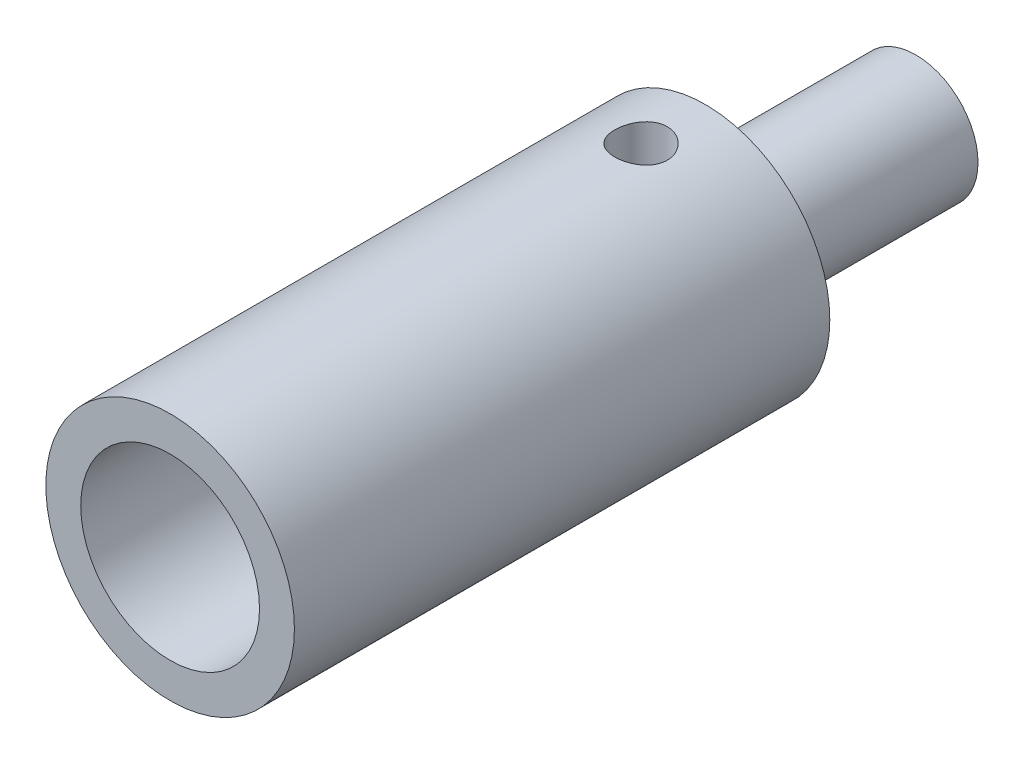
ISO-10303-21;
HEADER;
FILE_DESCRIPTION(('STEP AP214'),'2;1');
FILE_NAME('part.step','',(''),(''),'','','');
FILE_SCHEMA(('AUTOMOTIVE_DESIGN { 1 0 10303 214 1 1 1 1 }'));
ENDSEC;
DATA;
#1=APPLICATION_CONTEXT('core data for automotive mechanical design processes');
#2=APPLICATION_PROTOCOL_DEFINITION('international standard','automotive_design',2000,#1);
#3=PRODUCT_CONTEXT('',#1,'mechanical');
#4=PRODUCT('Part','Part','',(#3));
#5=PRODUCT_RELATED_PRODUCT_CATEGORY('part','',(#4));
#6=PRODUCT_DEFINITION_FORMATION('','',#4);
#7=PRODUCT_DEFINITION_CONTEXT('part definition',#1,'design');
#8=PRODUCT_DEFINITION('design','',#6,#7);
#9=PRODUCT_DEFINITION_SHAPE('','',#8);
#10=(LENGTH_UNIT() NAMED_UNIT(*) SI_UNIT(.MILLI.,.METRE.));
#11=(NAMED_UNIT(*) PLANE_ANGLE_UNIT() SI_UNIT($,.RADIAN.));
#12=(NAMED_UNIT(*) SI_UNIT($,.STERADIAN.) SOLID_ANGLE_UNIT());
#13=UNCERTAINTY_MEASURE_WITH_UNIT(LENGTH_MEASURE(1.E-05),#10,'distance_accuracy_value','');
#14=(GEOMETRIC_REPRESENTATION_CONTEXT(3) GLOBAL_UNCERTAINTY_ASSIGNED_CONTEXT((#13)) GLOBAL_UNIT_ASSIGNED_CONTEXT((#10,
#11,#12)) REPRESENTATION_CONTEXT('',''));
#15=CARTESIAN_POINT('',(0.,0.,0.));
#16=DIRECTION('',(0.,0.,1.));
#17=DIRECTION('',(1.,0.,0.));
#18=AXIS2_PLACEMENT_3D('',#15,#16,#17);
#19=CARTESIAN_POINT('',(0.,0.,40.));
#20=DIRECTION('',(0.,0.,1.));
#21=DIRECTION('',(1.,0.,0.));
#22=AXIS2_PLACEMENT_3D('',#19,#20,#21);
#23=PLANE('',#22);
#24=CARTESIAN_POINT('',(0.,0.,40.));
#25=DIRECTION('',(0.,0.,1.));
#26=DIRECTION('',(1.,0.,0.));
#27=AXIS2_PLACEMENT_3D('',#24,#25,#26);
#28=CIRCLE('',#27,13.);
#29=CARTESIAN_POINT('',(13.,0.,40.));
#30=VERTEX_POINT('',#29);
#31=EDGE_CURVE('E109',#30,#30,#28,.T.);
#32=ORIENTED_EDGE('',*,*,#31,.T.);
#33=EDGE_LOOP('',(#32));
#34=FACE_BOUND('',#33,.T.);
#35=CARTESIAN_POINT('',(0.,0.,40.));
#36=DIRECTION('',(0.,0.,1.));
#37=DIRECTION('',(1.,0.,0.));
#38=AXIS2_PLACEMENT_3D('',#35,#36,#37);
#39=CIRCLE('',#38,9.35);
#40=CARTESIAN_POINT('',(9.35,0.,40.));
#41=VERTEX_POINT('',#40);
#42=EDGE_CURVE('E112',#41,#41,#39,.T.);
#43=ORIENTED_EDGE('',*,*,#42,.F.);
#44=EDGE_LOOP('',(#43));
#45=FACE_BOUND('',#44,.T.);
#46=ADVANCED_FACE('F43',(#34,#45),#23,.T.);
#47=CARTESIAN_POINT('',(0.,0.,40.));
#48=DIRECTION('',(0.,0.,-1.));
#49=DIRECTION('',(-1.,0.,0.));
#50=AXIS2_PLACEMENT_3D('',#47,#48,#49);
#51=CYLINDRICAL_SURFACE('',#50,13.);
#52=CARTESIAN_POINT('',(0.,-13.,-6.5));
#53=CARTESIAN_POINT('',(0.152645962077536,-12.9999971744906,-6.50000537924892));
#54=CARTESIAN_POINT('',(0.305358081593092,-12.9972840185269,-6.51275244607873));
#55=CARTESIAN_POINT('',(0.606452918633867,-12.9867226158947,-6.56335589366979));
#56=CARTESIAN_POINT('',(0.75483232001695,-12.9788705383579,-6.60123100671147));
#57=CARTESIAN_POINT('',(1.04286600858037,-12.9589065584159,-6.70085780226605));
#58=CARTESIAN_POINT('',(1.1825289483597,-12.9467989621788,-6.76258535470068));
#59=CARTESIAN_POINT('',(1.44950915874221,-12.9196344100821,-6.90809011672705));
#60=CARTESIAN_POINT('',(1.57682691085872,-12.9045775693246,-6.99186646585084));
#61=CARTESIAN_POINT('',(1.81742731787956,-12.8729134147956,-7.18042716793185));
#62=CARTESIAN_POINT('',(1.93049731572373,-12.8562879150842,-7.28547983880073));
#63=CARTESIAN_POINT('',(2.13754963698808,-12.8234900046329,-7.51303478489724));
#64=CARTESIAN_POINT('',(2.23153034437314,-12.807317632353,-7.63553853598227));
#65=CARTESIAN_POINT('',(2.39866154698486,-12.777078477976,-7.89607377837681));
#66=CARTESIAN_POINT('',(2.47158808861181,-12.7630350383439,-8.03425188443456));
#67=CARTESIAN_POINT('',(2.59310501909661,-12.7389037851321,-8.32124730505201));
#68=CARTESIAN_POINT('',(2.64169811670187,-12.7288155312966,-8.47006343330115));
#69=CARTESIAN_POINT('',(2.71247084624843,-12.7139216369823,-8.7718110076379));
#70=CARTESIAN_POINT('',(2.73502567181802,-12.7090410376969,-8.92465067716463));
#71=CARTESIAN_POINT('',(2.75424774699293,-12.7048897370259,-9.23201663463604));
#72=CARTESIAN_POINT('',(2.75091796637808,-12.7056183920819,-9.38654272706349));
#73=CARTESIAN_POINT('',(2.7187678390813,-12.7125353119635,-9.69012340171508));
#74=CARTESIAN_POINT('',(2.69038106544394,-12.7186307089704,-9.83922633525146));
#75=CARTESIAN_POINT('',(2.60960866130122,-12.7354477253007,-10.1305045573943));
#76=CARTESIAN_POINT('',(2.5572217628024,-12.7461695890515,-10.2726794795355));
#77=CARTESIAN_POINT('',(2.42953184269831,-12.7711243188877,-10.5472967689874));
#78=CARTESIAN_POINT('',(2.35406008972322,-12.7853828852002,-10.6796582481492));
#79=CARTESIAN_POINT('',(2.1824616265169,-12.8157883911993,-10.9299994049792));
#80=CARTESIAN_POINT('',(2.08633227384418,-12.8319355723498,-11.0479772397175));
#81=CARTESIAN_POINT('',(1.87384189159505,-12.8646989180577,-11.2687006107151));
#82=CARTESIAN_POINT('',(1.75711163256378,-12.8813179699135,-11.3710905910432));
#83=CARTESIAN_POINT('',(1.50795175353122,-12.9128550366057,-11.554896427102));
#84=CARTESIAN_POINT('',(1.37552188371679,-12.9277730243672,-11.6363119490204));
#85=CARTESIAN_POINT('',(1.0983033928927,-12.9542707217835,-11.7759368812301));
#86=CARTESIAN_POINT('',(0.953491839338138,-12.9658440551888,-11.8341020468367));
#87=CARTESIAN_POINT('',(0.655851943601511,-12.9843006958433,-11.9251766670562));
#88=CARTESIAN_POINT('',(0.503024693258983,-12.9911846400691,-11.9580895518542));
#89=CARTESIAN_POINT('',(0.196743640878867,-12.9993969727823,-11.9972136136044));
#90=CARTESIAN_POINT('',(0.0433545564310915,-13.0008264737952,-12.0039108286299));
#91=CARTESIAN_POINT('',(-0.262350656185,-12.9982512157821,-11.9917275063259));
#92=CARTESIAN_POINT('',(-0.414666851578383,-12.9942468003343,-11.9728485861367));
#93=CARTESIAN_POINT('',(-0.712308884622769,-12.9813172481004,-11.9104522604824));
#94=CARTESIAN_POINT('',(-0.85769009501349,-12.9724426138311,-11.8671876041847));
#95=CARTESIAN_POINT('',(-1.13913306144815,-12.9507650829168,-11.7575267568941));
#96=CARTESIAN_POINT('',(-1.27519405873758,-12.9379618669115,-11.6911286852916));
#97=CARTESIAN_POINT('',(-1.53615992023197,-12.9095968655865,-11.536057894581));
#98=CARTESIAN_POINT('',(-1.66088958128669,-12.8940002058015,-11.4470968474891));
#99=CARTESIAN_POINT('',(-1.89382467929613,-12.8618536246895,-11.2498075506241));
#100=CARTESIAN_POINT('',(-2.00202811542597,-12.8453035882709,-11.1414769592272));
#101=CARTESIAN_POINT('',(-2.20074297017916,-12.8127695848599,-10.9063000796242));
#102=CARTESIAN_POINT('',(-2.2909189287012,-12.7968002051884,-10.7791679596948));
#103=CARTESIAN_POINT('',(-2.44863982384162,-12.7675613719899,-10.5112769567139));
#104=CARTESIAN_POINT('',(-2.51618571523553,-12.7542918045655,-10.3705186488822));
#105=CARTESIAN_POINT('',(-2.62628874015814,-12.7320762445085,-10.0801113161874));
#106=CARTESIAN_POINT('',(-2.66898261893207,-12.7231066409567,-9.93051603012556));
#107=CARTESIAN_POINT('',(-2.72857630004031,-12.7104608986613,-9.62606227674194));
#108=CARTESIAN_POINT('',(-2.74547992288419,-12.7067839758766,-9.47120459245499));
#109=CARTESIAN_POINT('',(-2.75285891424671,-12.7051870263941,-9.16399841097116));
#110=CARTESIAN_POINT('',(-2.74386542111311,-12.7071512990771,-9.01166302957593));
#111=CARTESIAN_POINT('',(-2.70088690169248,-12.716354993442,-8.7107302939286));
#112=CARTESIAN_POINT('',(-2.66690213141889,-12.7235943610854,-8.56213290140024));
#113=CARTESIAN_POINT('',(-2.57515476031398,-12.7424779644021,-8.27328314828439));
#114=CARTESIAN_POINT('',(-2.51746468026713,-12.7541087568219,-8.13300681624703));
#115=CARTESIAN_POINT('',(-2.38000845156237,-12.7804708744326,-7.86404353900933));
#116=CARTESIAN_POINT('',(-2.30024017655954,-12.7952024982311,-7.73535771167035));
#117=CARTESIAN_POINT('',(-2.11910956777733,-12.8264553311746,-7.49059952947836));
#118=CARTESIAN_POINT('',(-2.01736669231322,-12.8430051614239,-7.37481239179587));
#119=CARTESIAN_POINT('',(-1.79595202920055,-12.8758322990186,-7.1617799419211));
#120=CARTESIAN_POINT('',(-1.67627611520153,-12.8921095426816,-7.064538908879));
#121=CARTESIAN_POINT('',(-1.42066876281656,-12.9227879846769,-6.89025088004786));
#122=CARTESIAN_POINT('',(-1.28455998323047,-12.9371644097812,-6.81345938804723));
#123=CARTESIAN_POINT('',(-1.00109625065506,-12.9621748814499,-6.6839637120686));
#124=CARTESIAN_POINT('',(-0.853751138149071,-12.9728121578805,-6.63123872769613));
#125=CARTESIAN_POINT('',(-0.588486618989593,-12.9871810038262,-6.56109241027281));
#126=CARTESIAN_POINT('',(-0.472033128506385,-12.9919590062313,-6.53822532174934));
#127=CARTESIAN_POINT('',(-0.237066340083529,-12.9983695400573,-6.50767732454081));
#128=CARTESIAN_POINT('',(-0.118553122850467,-13.0000021944437,-6.4999958221839));
#129=CARTESIAN_POINT('',(0.,-13.,-6.5));
#130=B_SPLINE_CURVE_WITH_KNOTS('',3,(#52,#53,#54,#55,#56,#57,#58,#59,#60,#61,#62,#63,#64,#65,
#66,#67,#68,#69,#70,#71,#72,#73,#74,#75,#76,#77,#78,#79,#80,#81,#82,#83,#84,#85,#86,#87,#88,#89,
#90,#91,#92,#93,#94,#95,#96,#97,#98,#99,#100,#101,#102,#103,#104,#105,#106,#107,#108,#109,#110,
#111,#112,#113,#114,#115,#116,#117,#118,#119,#120,#121,#122,#123,#124,#125,#126,#127,#128,#129),
.UNSPECIFIED.,.T.,.F.,(4,2,2,2,2,2,2,2,2,2,2,2,2,2,2,2,2,2,2,2,2,2,2,2,2,2,2,2,2,2,2,2,2,2,2,2,
2,2,4),(0.,0.457504033798627,0.915349508311294,1.37273301559827,1.83009867585675,
2.29363823820455,2.75721702591176,3.2255591080224,3.69384904368927,4.15530353630205,
4.61670508632743,5.07027594517254,5.52387077019395,5.98086360494935,6.4379149313217,
6.90419238225565,7.37047725362043,7.83764527353902,8.30474982367934,8.76315205913213,
9.2215253118587,9.67523282094087,10.1289772223653,10.5888409991235,11.0487604073873,
11.5165720948162,11.9843640425152,12.4495570773074,12.914681192773,13.3703341860563,
13.8259825116446,14.2802471461342,14.7345555459593,15.1974725825382,15.6604962992783,
16.1290592926962,16.5972165423292,16.9525528495246,17.3078752647743),.UNSPECIFIED.);
#131=CARTESIAN_POINT('',(0.,-13.,-6.5));
#132=VERTEX_POINT('',#131);
#133=EDGE_CURVE('E10',#132,#132,#130,.T.);
#134=ORIENTED_EDGE('',*,*,#133,.T.);
#135=EDGE_LOOP('',(#134));
#136=FACE_BOUND('',#135,.T.);
#137=CARTESIAN_POINT('',(0.,13.,-6.5));
#138=CARTESIAN_POINT('',(-0.152645962077536,12.9999971744906,-6.50000537924892));
#139=CARTESIAN_POINT('',(-0.305358081593092,12.9972840185269,-6.51275244607873));
#140=CARTESIAN_POINT('',(-0.606452918633867,12.9867226158947,-6.56335589366979));
#141=CARTESIAN_POINT('',(-0.75483232001695,12.9788705383579,-6.60123100671147));
#142=CARTESIAN_POINT('',(-1.04286600858037,12.9589065584159,-6.70085780226605));
#143=CARTESIAN_POINT('',(-1.1825289483597,12.9467989621788,-6.76258535470068));
#144=CARTESIAN_POINT('',(-1.44950915874221,12.9196344100821,-6.90809011672705));
#145=CARTESIAN_POINT('',(-1.57682691085872,12.9045775693246,-6.99186646585084));
#146=CARTESIAN_POINT('',(-1.81742731787956,12.8729134147956,-7.18042716793185));
#147=CARTESIAN_POINT('',(-1.93049731572373,12.8562879150842,-7.28547983880073));
#148=CARTESIAN_POINT('',(-2.13754963698808,12.8234900046329,-7.51303478489724));
#149=CARTESIAN_POINT('',(-2.23153034437314,12.807317632353,-7.63553853598227));
#150=CARTESIAN_POINT('',(-2.39866154698486,12.777078477976,-7.89607377837681));
#151=CARTESIAN_POINT('',(-2.47158808861181,12.7630350383439,-8.03425188443456));
#152=CARTESIAN_POINT('',(-2.59310501909661,12.7389037851321,-8.32124730505201));
#153=CARTESIAN_POINT('',(-2.64169811670187,12.7288155312966,-8.47006343330115));
#154=CARTESIAN_POINT('',(-2.71247084624843,12.7139216369823,-8.7718110076379));
#155=CARTESIAN_POINT('',(-2.73502567181802,12.7090410376969,-8.92465067716463));
#156=CARTESIAN_POINT('',(-2.75424774699293,12.7048897370259,-9.23201663463604));
#157=CARTESIAN_POINT('',(-2.75091796637808,12.7056183920819,-9.38654272706349));
#158=CARTESIAN_POINT('',(-2.7187678390813,12.7125353119635,-9.69012340171508));
#159=CARTESIAN_POINT('',(-2.69038106544394,12.7186307089704,-9.83922633525146));
#160=CARTESIAN_POINT('',(-2.60960866130122,12.7354477253007,-10.1305045573943));
#161=CARTESIAN_POINT('',(-2.5572217628024,12.7461695890515,-10.2726794795355));
#162=CARTESIAN_POINT('',(-2.42953184269831,12.7711243188877,-10.5472967689874));
#163=CARTESIAN_POINT('',(-2.35406008972322,12.7853828852002,-10.6796582481492));
#164=CARTESIAN_POINT('',(-2.1824616265169,12.8157883911993,-10.9299994049792));
#165=CARTESIAN_POINT('',(-2.08633227384418,12.8319355723498,-11.0479772397175));
#166=CARTESIAN_POINT('',(-1.87384189159505,12.8646989180577,-11.2687006107151));
#167=CARTESIAN_POINT('',(-1.75711163256378,12.8813179699135,-11.3710905910432));
#168=CARTESIAN_POINT('',(-1.50795175353122,12.9128550366057,-11.554896427102));
#169=CARTESIAN_POINT('',(-1.37552188371679,12.9277730243672,-11.6363119490204));
#170=CARTESIAN_POINT('',(-1.0983033928927,12.9542707217835,-11.7759368812301));
#171=CARTESIAN_POINT('',(-0.953491839338138,12.9658440551888,-11.8341020468367));
#172=CARTESIAN_POINT('',(-0.655851943601511,12.9843006958433,-11.9251766670562));
#173=CARTESIAN_POINT('',(-0.503024693258983,12.9911846400691,-11.9580895518542));
#174=CARTESIAN_POINT('',(-0.196743640878867,12.9993969727823,-11.9972136136044));
#175=CARTESIAN_POINT('',(-0.0433545564310915,13.0008264737952,-12.0039108286299));
#176=CARTESIAN_POINT('',(0.262350656185,12.9982512157821,-11.9917275063259));
#177=CARTESIAN_POINT('',(0.414666851578383,12.9942468003343,-11.9728485861367));
#178=CARTESIAN_POINT('',(0.712308884622769,12.9813172481004,-11.9104522604824));
#179=CARTESIAN_POINT('',(0.85769009501349,12.9724426138311,-11.8671876041847));
#180=CARTESIAN_POINT('',(1.13913306144815,12.9507650829168,-11.7575267568941));
#181=CARTESIAN_POINT('',(1.27519405873758,12.9379618669115,-11.6911286852916));
#182=CARTESIAN_POINT('',(1.53615992023197,12.9095968655865,-11.536057894581));
#183=CARTESIAN_POINT('',(1.66088958128669,12.8940002058015,-11.4470968474891));
#184=CARTESIAN_POINT('',(1.89382467929613,12.8618536246895,-11.2498075506241));
#185=CARTESIAN_POINT('',(2.00202811542597,12.8453035882709,-11.1414769592272));
#186=CARTESIAN_POINT('',(2.20074297017916,12.8127695848599,-10.9063000796242));
#187=CARTESIAN_POINT('',(2.2909189287012,12.7968002051884,-10.7791679596948));
#188=CARTESIAN_POINT('',(2.44863982384162,12.7675613719899,-10.5112769567139));
#189=CARTESIAN_POINT('',(2.51618571523553,12.7542918045655,-10.3705186488822));
#190=CARTESIAN_POINT('',(2.62628874015814,12.7320762445085,-10.0801113161874));
#191=CARTESIAN_POINT('',(2.66898261893207,12.7231066409567,-9.93051603012556));
#192=CARTESIAN_POINT('',(2.72857630004031,12.7104608986613,-9.62606227674194));
#193=CARTESIAN_POINT('',(2.74547992288419,12.7067839758766,-9.47120459245499));
#194=CARTESIAN_POINT('',(2.75285891424671,12.7051870263941,-9.16399841097116));
#195=CARTESIAN_POINT('',(2.74386542111311,12.7071512990771,-9.01166302957593));
#196=CARTESIAN_POINT('',(2.70088690169248,12.716354993442,-8.7107302939286));
#197=CARTESIAN_POINT('',(2.66690213141889,12.7235943610854,-8.56213290140024));
#198=CARTESIAN_POINT('',(2.57515476031398,12.7424779644021,-8.27328314828439));
#199=CARTESIAN_POINT('',(2.51746468026713,12.7541087568219,-8.13300681624703));
#200=CARTESIAN_POINT('',(2.38000845156237,12.7804708744326,-7.86404353900933));
#201=CARTESIAN_POINT('',(2.30024017655954,12.7952024982311,-7.73535771167035));
#202=CARTESIAN_POINT('',(2.11910956777733,12.8264553311746,-7.49059952947836));
#203=CARTESIAN_POINT('',(2.01736669231322,12.8430051614239,-7.37481239179587));
#204=CARTESIAN_POINT('',(1.79595202920055,12.8758322990186,-7.1617799419211));
#205=CARTESIAN_POINT('',(1.67627611520153,12.8921095426816,-7.064538908879));
#206=CARTESIAN_POINT('',(1.42066876281656,12.9227879846769,-6.89025088004786));
#207=CARTESIAN_POINT('',(1.28455998323047,12.9371644097812,-6.81345938804723));
#208=CARTESIAN_POINT('',(1.00109625065506,12.9621748814499,-6.6839637120686));
#209=CARTESIAN_POINT('',(0.853751138149071,12.9728121578805,-6.63123872769613));
#210=CARTESIAN_POINT('',(0.588486618989593,12.9871810038262,-6.56109241027281));
#211=CARTESIAN_POINT('',(0.472033128506385,12.9919590062313,-6.53822532174934));
#212=CARTESIAN_POINT('',(0.237066340083529,12.9983695400573,-6.50767732454081));
#213=CARTESIAN_POINT('',(0.118553122850467,13.0000021944437,-6.4999958221839));
#214=CARTESIAN_POINT('',(0.,13.,-6.5));
#215=B_SPLINE_CURVE_WITH_KNOTS('',3,(#137,#138,#139,#140,#141,#142,#143,#144,#145,#146,#147,
#148,#149,#150,#151,#152,#153,#154,#155,#156,#157,#158,#159,#160,#161,#162,#163,#164,#165,#166,
#167,#168,#169,#170,#171,#172,#173,#174,#175,#176,#177,#178,#179,#180,#181,#182,#183,#184,#185,
#186,#187,#188,#189,#190,#191,#192,#193,#194,#195,#196,#197,#198,#199,#200,#201,#202,#203,#204,
#205,#206,#207,#208,#209,#210,#211,#212,#213,#214),.UNSPECIFIED.,.T.,.F.,(4,2,2,2,2,2,2,2,2,2,2,
2,2,2,2,2,2,2,2,2,2,2,2,2,2,2,2,2,2,2,2,2,2,2,2,2,2,2,4),(0.,0.457504033798627,
0.915349508311294,1.37273301559827,1.83009867585675,2.29363823820455,2.75721702591176,
3.2255591080224,3.69384904368927,4.15530353630205,4.61670508632743,5.07027594517254,
5.52387077019395,5.98086360494935,6.4379149313217,6.90419238225565,7.37047725362043,
7.83764527353902,8.30474982367934,8.76315205913213,9.2215253118587,9.67523282094087,
10.1289772223653,10.5888409991235,11.0487604073873,11.5165720948162,11.9843640425152,
12.4495570773074,12.914681192773,13.3703341860563,13.8259825116446,14.2802471461342,
14.7345555459593,15.1974725825382,15.6604962992783,16.1290592926962,16.5972165423292,
16.9525528495246,17.3078752647743),.UNSPECIFIED.);
#216=CARTESIAN_POINT('',(0.,13.,-6.5));
#217=VERTEX_POINT('',#216);
#218=EDGE_CURVE('E56',#217,#217,#215,.T.);
#219=ORIENTED_EDGE('',*,*,#218,.T.);
#220=EDGE_LOOP('',(#219));
#221=FACE_BOUND('',#220,.T.);
#222=ORIENTED_EDGE('',*,*,#31,.F.);
#223=EDGE_LOOP('',(#222));
#224=FACE_BOUND('',#223,.T.);
#225=CARTESIAN_POINT('',(0.,0.,-16.));
#226=DIRECTION('',(0.,0.,1.));
#227=DIRECTION('',(1.,0.,0.));
#228=AXIS2_PLACEMENT_3D('',#225,#226,#227);
#229=CIRCLE('',#228,13.);
#230=CARTESIAN_POINT('',(13.,0.,-16.));
#231=VERTEX_POINT('',#230);
#232=EDGE_CURVE('E115',#231,#231,#229,.T.);
#233=ORIENTED_EDGE('',*,*,#232,.T.);
#234=EDGE_LOOP('',(#233));
#235=FACE_BOUND('',#234,.T.);
#236=ADVANCED_FACE('F72',(#136,#221,#224,#235),#51,.T.);
#237=CARTESIAN_POINT('',(0.,0.,40.));
#238=DIRECTION('',(0.,0.,-1.));
#239=DIRECTION('',(-1.,0.,0.));
#240=AXIS2_PLACEMENT_3D('',#237,#238,#239);
#241=CYLINDRICAL_SURFACE('',#240,9.35);
#242=CARTESIAN_POINT('',(0.,0.,0.5));
#243=DIRECTION('',(0.,0.,1.));
#244=DIRECTION('',(1.,0.,0.));
#245=AXIS2_PLACEMENT_3D('',#242,#243,#244);
#246=CIRCLE('',#245,9.35);
#247=CARTESIAN_POINT('',(9.35,0.,0.5));
#248=VERTEX_POINT('',#247);
#249=EDGE_CURVE('E61',#248,#248,#246,.F.);
#250=ORIENTED_EDGE('',*,*,#249,.T.);
#251=EDGE_LOOP('',(#250));
#252=FACE_BOUND('',#251,.T.);
#253=ORIENTED_EDGE('',*,*,#42,.T.);
#254=EDGE_LOOP('',(#253));
#255=FACE_BOUND('',#254,.T.);
#256=ADVANCED_FACE('F97',(#252,#255),#241,.F.);
#257=CARTESIAN_POINT('',(0.,0.,0.));
#258=DIRECTION('',(0.,0.,1.));
#259=DIRECTION('',(1.,0.,0.));
#260=AXIS2_PLACEMENT_3D('',#257,#258,#259);
#261=PLANE('',#260);
#262=CARTESIAN_POINT('',(0.,0.,0.));
#263=DIRECTION('',(0.,0.,1.));
#264=DIRECTION('',(1.,0.,0.));
#265=AXIS2_PLACEMENT_3D('',#262,#263,#264);
#266=CIRCLE('',#265,8.85);
#267=CARTESIAN_POINT('',(8.85,0.,0.));
#268=VERTEX_POINT('',#267);
#269=EDGE_CURVE('E66',#268,#268,#266,.T.);
#270=ORIENTED_EDGE('',*,*,#269,.T.);
#271=EDGE_LOOP('',(#270));
#272=FACE_BOUND('',#271,.T.);
#273=ADVANCED_FACE('F93',(#272),#261,.T.);
#274=CARTESIAN_POINT('',(0.,0.,-16.));
#275=DIRECTION('',(0.,0.,1.));
#276=DIRECTION('',(1.,0.,0.));
#277=AXIS2_PLACEMENT_3D('',#274,#275,#276);
#278=PLANE('',#277);
#279=CARTESIAN_POINT('',(0.,0.,-16.));
#280=DIRECTION('',(0.,0.,1.));
#281=DIRECTION('',(1.,0.,0.));
#282=AXIS2_PLACEMENT_3D('',#279,#280,#281);
#283=CIRCLE('',#282,7.);
#284=CARTESIAN_POINT('',(7.,0.,-16.));
#285=VERTEX_POINT('',#284);
#286=EDGE_CURVE('E129',#285,#285,#283,.T.);
#287=ORIENTED_EDGE('',*,*,#286,.T.);
#288=EDGE_LOOP('',(#287));
#289=FACE_BOUND('',#288,.T.);
#290=ORIENTED_EDGE('',*,*,#232,.F.);
#291=EDGE_LOOP('',(#290));
#292=FACE_BOUND('',#291,.T.);
#293=ADVANCED_FACE('F89',(#289,#292),#278,.F.);
#294=CARTESIAN_POINT('',(0.,0.,-38.));
#295=DIRECTION('',(0.,0.,1.));
#296=DIRECTION('',(1.,0.,0.));
#297=AXIS2_PLACEMENT_3D('',#294,#295,#296);
#298=CYLINDRICAL_SURFACE('',#297,6.5);
#299=CARTESIAN_POINT('',(0.,0.,-16.5));
#300=DIRECTION('',(0.,0.,1.));
#301=DIRECTION('',(1.,0.,0.));
#302=AXIS2_PLACEMENT_3D('',#299,#300,#301);
#303=CIRCLE('',#302,6.5);
#304=CARTESIAN_POINT('',(6.5,0.,-16.5));
#305=VERTEX_POINT('',#304);
#306=EDGE_CURVE('E119',#305,#305,#303,.F.);
#307=ORIENTED_EDGE('',*,*,#306,.T.);
#308=EDGE_LOOP('',(#307));
#309=FACE_BOUND('',#308,.T.);
#310=CARTESIAN_POINT('',(0.,0.,-38.));
#311=DIRECTION('',(0.,0.,-1.));
#312=DIRECTION('',(-1.,0.,0.));
#313=AXIS2_PLACEMENT_3D('',#310,#311,#312);
#314=CIRCLE('',#313,6.5);
#315=CARTESIAN_POINT('',(-6.5,0.,-38.));
#316=VERTEX_POINT('',#315);
#317=EDGE_CURVE('E122',#316,#316,#314,.T.);
#318=ORIENTED_EDGE('',*,*,#317,.F.);
#319=EDGE_LOOP('',(#318));
#320=FACE_BOUND('',#319,.T.);
#321=ADVANCED_FACE('F85',(#309,#320),#298,.T.);
#322=CARTESIAN_POINT('',(0.,0.,-38.));
#323=DIRECTION('',(0.,0.,-1.));
#324=DIRECTION('',(-1.,0.,0.));
#325=AXIS2_PLACEMENT_3D('',#322,#323,#324);
#326=PLANE('',#325);
#327=ORIENTED_EDGE('',*,*,#317,.T.);
#328=EDGE_LOOP('',(#327));
#329=FACE_BOUND('',#328,.T.);
#330=ADVANCED_FACE('F80',(#329),#326,.T.);
#331=CARTESIAN_POINT('',(0.,0.,-16.5));
#332=DIRECTION('',(0.,0.,1.));
#333=DIRECTION('',(1.,0.,0.));
#334=AXIS2_PLACEMENT_3D('',#331,#332,#333);
#335=TOROIDAL_SURFACE('',#334,7.,0.5);
#336=ORIENTED_EDGE('',*,*,#286,.F.);
#337=EDGE_LOOP('',(#336));
#338=FACE_BOUND('',#337,.T.);
#339=ORIENTED_EDGE('',*,*,#306,.F.);
#340=EDGE_LOOP('',(#339));
#341=FACE_BOUND('',#340,.T.);
#342=ADVANCED_FACE('F84',(#338,#341),#335,.F.);
#343=CARTESIAN_POINT('',(0.,0.,0.5));
#344=DIRECTION('',(0.,0.,1.));
#345=DIRECTION('',(1.,0.,0.));
#346=AXIS2_PLACEMENT_3D('',#343,#344,#345);
#347=TOROIDAL_SURFACE('',#346,8.85,0.5);
#348=ORIENTED_EDGE('',*,*,#249,.F.);
#349=EDGE_LOOP('',(#348));
#350=FACE_BOUND('',#349,.T.);
#351=ORIENTED_EDGE('',*,*,#269,.F.);
#352=EDGE_LOOP('',(#351));
#353=FACE_BOUND('',#352,.T.);
#354=ADVANCED_FACE('F45',(#350,#353),#347,.F.);
#355=CARTESIAN_POINT('',(0.,-13.,-9.25));
#356=DIRECTION('',(0.,1.,0.));
#357=DIRECTION('',(0.,0.,1.));
#358=AXIS2_PLACEMENT_3D('',#355,#356,#357);
#359=CYLINDRICAL_SURFACE('',#358,2.75);
#360=ORIENTED_EDGE('',*,*,#218,.F.);
#361=EDGE_LOOP('',(#360));
#362=FACE_BOUND('',#361,.T.);
#363=ORIENTED_EDGE('',*,*,#133,.F.);
#364=EDGE_LOOP('',(#363));
#365=FACE_BOUND('',#364,.T.);
#366=ADVANCED_FACE('F75',(#362,#365),#359,.F.);
#367=CLOSED_SHELL('',(#46,#236,#256,#273,#293,#321,#330,#342,#354,#366));
#368=MANIFOLD_SOLID_BREP('B2',#367);
#369=ADVANCED_BREP_SHAPE_REPRESENTATION('',(#18,#368),#14);
#370=SHAPE_DEFINITION_REPRESENTATION(#9,#369);
ENDSEC;
END-ISO-10303-21;
